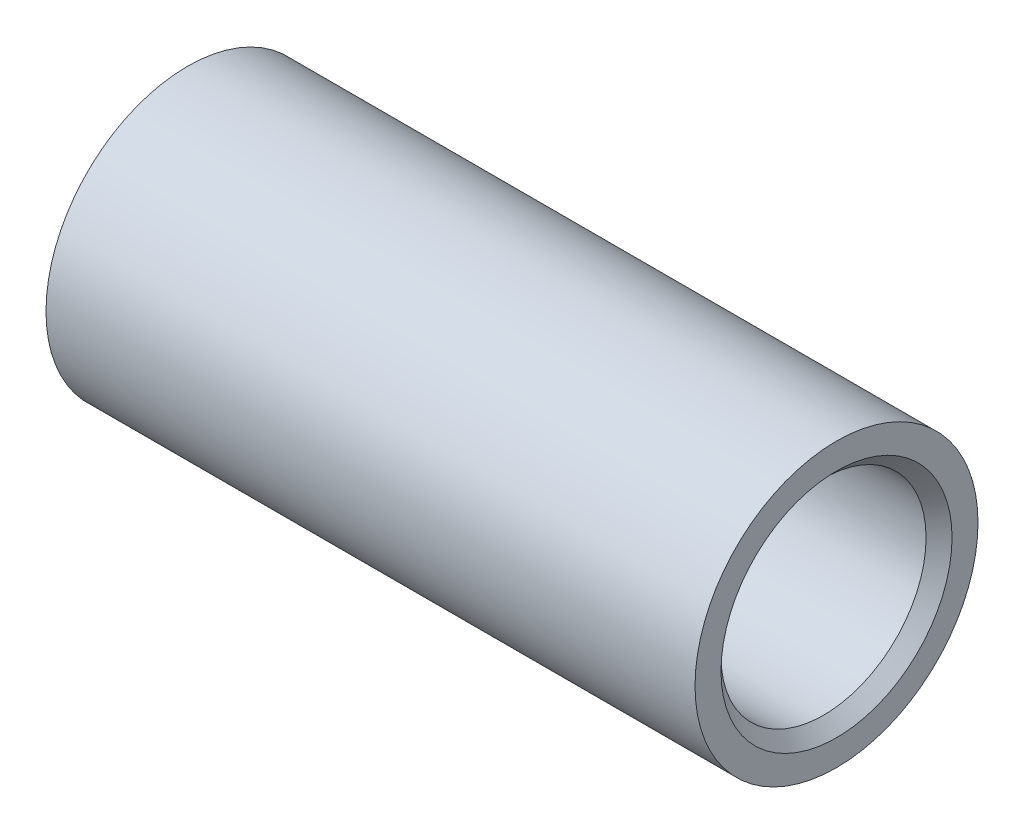
ISO-10303-21;
HEADER;
FILE_DESCRIPTION(('STEP AP214'),'2;1');
FILE_NAME('part.step','',(''),(''),'','','');
FILE_SCHEMA(('AUTOMOTIVE_DESIGN { 1 0 10303 214 1 1 1 1 }'));
ENDSEC;
DATA;
#1=APPLICATION_CONTEXT('core data for automotive mechanical design processes');
#2=APPLICATION_PROTOCOL_DEFINITION('international standard','automotive_design',2000,#1);
#3=PRODUCT_CONTEXT('',#1,'mechanical');
#4=PRODUCT('Part','Part','',(#3));
#5=PRODUCT_RELATED_PRODUCT_CATEGORY('part','',(#4));
#6=PRODUCT_DEFINITION_FORMATION('','',#4);
#7=PRODUCT_DEFINITION_CONTEXT('part definition',#1,'design');
#8=PRODUCT_DEFINITION('design','',#6,#7);
#9=PRODUCT_DEFINITION_SHAPE('','',#8);
#10=(LENGTH_UNIT() NAMED_UNIT(*) SI_UNIT(.MILLI.,.METRE.));
#11=(NAMED_UNIT(*) PLANE_ANGLE_UNIT() SI_UNIT($,.RADIAN.));
#12=(NAMED_UNIT(*) SI_UNIT($,.STERADIAN.) SOLID_ANGLE_UNIT());
#13=UNCERTAINTY_MEASURE_WITH_UNIT(LENGTH_MEASURE(1.E-05),#10,'distance_accuracy_value','');
#14=(GEOMETRIC_REPRESENTATION_CONTEXT(3) GLOBAL_UNCERTAINTY_ASSIGNED_CONTEXT((#13)) GLOBAL_UNIT_ASSIGNED_CONTEXT((#10,
#11,#12)) REPRESENTATION_CONTEXT('',''));
#15=CARTESIAN_POINT('',(0.,0.,0.));
#16=DIRECTION('',(0.,0.,1.));
#17=DIRECTION('',(1.,0.,0.));
#18=AXIS2_PLACEMENT_3D('',#15,#16,#17);
#19=CARTESIAN_POINT('',(0.,2.7686,0.));
#20=DIRECTION('',(1.,0.,0.));
#21=DIRECTION('',(0.,0.,-1.));
#22=AXIS2_PLACEMENT_3D('',#19,#20,#21);
#23=PLANE('',#22);
#24=CARTESIAN_POINT('',(0.,0.,0.));
#25=DIRECTION('',(-1.,0.,0.));
#26=DIRECTION('',(0.,0.,1.));
#27=AXIS2_PLACEMENT_3D('',#24,#25,#26);
#28=CIRCLE('',#27,2.0066);
#29=CARTESIAN_POINT('',(0.,0.,2.0066));
#30=VERTEX_POINT('',#29);
#31=EDGE_CURVE('E91',#30,#30,#28,.T.);
#32=ORIENTED_EDGE('',*,*,#31,.F.);
#33=EDGE_LOOP('',(#32));
#34=FACE_BOUND('',#33,.T.);
#35=CARTESIAN_POINT('',(0.,0.,0.));
#36=DIRECTION('',(-1.,0.,0.));
#37=DIRECTION('',(0.,0.,1.));
#38=AXIS2_PLACEMENT_3D('',#35,#36,#37);
#39=CIRCLE('',#38,2.7686);
#40=CARTESIAN_POINT('',(0.,0.,2.7686));
#41=VERTEX_POINT('',#40);
#42=EDGE_CURVE('E64',#41,#41,#39,.T.);
#43=ORIENTED_EDGE('',*,*,#42,.T.);
#44=EDGE_LOOP('',(#43));
#45=FACE_BOUND('',#44,.T.);
#46=ADVANCED_FACE('F50',(#34,#45),#23,.F.);
#47=CARTESIAN_POINT('',(-4.56175733291189,0.,0.));
#48=DIRECTION('',(-1.,0.,0.));
#49=DIRECTION('',(0.,0.,1.));
#50=AXIS2_PLACEMENT_3D('',#47,#48,#49);
#51=CYLINDRICAL_SURFACE('',#50,2.7686);
#52=ORIENTED_EDGE('',*,*,#42,.F.);
#53=EDGE_LOOP('',(#52));
#54=FACE_BOUND('',#53,.T.);
#55=CARTESIAN_POINT('',(12.7,0.,0.));
#56=DIRECTION('',(-1.,0.,0.));
#57=DIRECTION('',(0.,0.,1.));
#58=AXIS2_PLACEMENT_3D('',#55,#56,#57);
#59=CIRCLE('',#58,2.7686);
#60=CARTESIAN_POINT('',(12.7,0.,2.7686));
#61=VERTEX_POINT('',#60);
#62=EDGE_CURVE('E69',#61,#61,#59,.T.);
#63=ORIENTED_EDGE('',*,*,#62,.T.);
#64=EDGE_LOOP('',(#63));
#65=FACE_BOUND('',#64,.T.);
#66=ADVANCED_FACE('F100',(#54,#65),#51,.T.);
#67=CARTESIAN_POINT('',(12.7,2.7686,0.));
#68=DIRECTION('',(-1.,0.,0.));
#69=DIRECTION('',(0.,0.,1.));
#70=AXIS2_PLACEMENT_3D('',#67,#68,#69);
#71=PLANE('',#70);
#72=CARTESIAN_POINT('',(12.7,0.,0.));
#73=DIRECTION('',(-1.,0.,0.));
#74=DIRECTION('',(0.,0.,1.));
#75=AXIS2_PLACEMENT_3D('',#72,#73,#74);
#76=CIRCLE('',#75,2.2606);
#77=CARTESIAN_POINT('',(12.7,0.,2.2606));
#78=VERTEX_POINT('',#77);
#79=EDGE_CURVE('E59',#78,#78,#76,.T.);
#80=ORIENTED_EDGE('',*,*,#79,.T.);
#81=EDGE_LOOP('',(#80));
#82=FACE_BOUND('',#81,.T.);
#83=ORIENTED_EDGE('',*,*,#62,.F.);
#84=EDGE_LOOP('',(#83));
#85=FACE_BOUND('',#84,.T.);
#86=ADVANCED_FACE('F105',(#82,#85),#71,.F.);
#87=CARTESIAN_POINT('',(-4.56175733291189,0.,0.));
#88=DIRECTION('',(-1.,0.,0.));
#89=DIRECTION('',(0.,0.,1.));
#90=AXIS2_PLACEMENT_3D('',#87,#88,#89);
#91=CYLINDRICAL_SURFACE('',#90,2.0066);
#92=CARTESIAN_POINT('',(12.446,0.,0.));
#93=DIRECTION('',(-1.,0.,0.));
#94=DIRECTION('',(0.,0.,1.));
#95=AXIS2_PLACEMENT_3D('',#92,#93,#94);
#96=CIRCLE('',#95,2.0066);
#97=CARTESIAN_POINT('',(12.446,0.,2.0066));
#98=VERTEX_POINT('',#97);
#99=EDGE_CURVE('E12',#98,#98,#96,.F.);
#100=ORIENTED_EDGE('',*,*,#99,.T.);
#101=EDGE_LOOP('',(#100));
#102=FACE_BOUND('',#101,.T.);
#103=CARTESIAN_POINT('',(4.3434,0.,0.));
#104=DIRECTION('',(-1.,0.,0.));
#105=DIRECTION('',(0.,0.,1.));
#106=AXIS2_PLACEMENT_3D('',#103,#104,#105);
#107=CIRCLE('',#106,2.0066);
#108=CARTESIAN_POINT('',(4.3434,0.,2.0066));
#109=VERTEX_POINT('',#108);
#110=EDGE_CURVE('E75',#109,#109,#107,.T.);
#111=ORIENTED_EDGE('',*,*,#110,.T.);
#112=EDGE_LOOP('',(#111));
#113=FACE_BOUND('',#112,.T.);
#114=ADVANCED_FACE('F110',(#102,#113),#91,.F.);
#115=CARTESIAN_POINT('',(2.4531587330311,0.,0.));
#116=DIRECTION('',(-1.,0.,0.));
#117=DIRECTION('',(0.,0.,1.));
#118=AXIS2_PLACEMENT_3D('',#115,#116,#117);
#119=DEGENERATE_TOROIDAL_SURFACE('',#118,0.30995980459975,2.54,.T.);
#120=ORIENTED_EDGE('',*,*,#110,.F.);
#121=EDGE_LOOP('',(#120));
#122=FACE_BOUND('',#121,.T.);
#123=CARTESIAN_POINT('',(4.99216509195135,0.,0.));
#124=DIRECTION('',(-1.,0.,0.));
#125=DIRECTION('',(0.,0.,1.));
#126=AXIS2_PLACEMENT_3D('',#123,#124,#125);
#127=CIRCLE('',#126,0.381);
#128=CARTESIAN_POINT('',(4.99216509195135,0.,0.381));
#129=VERTEX_POINT('',#128);
#130=EDGE_CURVE('E79',#129,#129,#127,.T.);
#131=ORIENTED_EDGE('',*,*,#130,.T.);
#132=EDGE_LOOP('',(#131));
#133=FACE_BOUND('',#132,.T.);
#134=ADVANCED_FACE('F115',(#122,#133),#119,.T.);
#135=CARTESIAN_POINT('',(-4.56175733291189,0.,0.));
#136=DIRECTION('',(-1.,0.,0.));
#137=DIRECTION('',(0.,0.,1.));
#138=AXIS2_PLACEMENT_3D('',#135,#136,#137);
#139=CYLINDRICAL_SURFACE('',#138,0.381);
#140=ORIENTED_EDGE('',*,*,#130,.F.);
#141=EDGE_LOOP('',(#140));
#142=FACE_BOUND('',#141,.T.);
#143=CARTESIAN_POINT('',(4.48416509195135,0.,0.));
#144=DIRECTION('',(-1.,0.,0.));
#145=DIRECTION('',(0.,0.,1.));
#146=AXIS2_PLACEMENT_3D('',#143,#144,#145);
#147=CIRCLE('',#146,0.381);
#148=CARTESIAN_POINT('',(4.48416509195135,0.,0.381));
#149=VERTEX_POINT('',#148);
#150=EDGE_CURVE('E83',#149,#149,#147,.T.);
#151=ORIENTED_EDGE('',*,*,#150,.T.);
#152=EDGE_LOOP('',(#151));
#153=FACE_BOUND('',#152,.T.);
#154=ADVANCED_FACE('F120',(#142,#153),#139,.F.);
#155=CARTESIAN_POINT('',(1.9451587330311,0.,0.));
#156=DIRECTION('',(-1.,0.,0.));
#157=DIRECTION('',(0.,0.,1.));
#158=AXIS2_PLACEMENT_3D('',#155,#156,#157);
#159=DEGENERATE_TOROIDAL_SURFACE('',#158,0.309959804599751,2.54,.T.);
#160=ORIENTED_EDGE('',*,*,#150,.F.);
#161=EDGE_LOOP('',(#160));
#162=FACE_BOUND('',#161,.T.);
#163=CARTESIAN_POINT('',(3.8354,0.,0.));
#164=DIRECTION('',(-1.,0.,0.));
#165=DIRECTION('',(0.,0.,1.));
#166=AXIS2_PLACEMENT_3D('',#163,#164,#165);
#167=CIRCLE('',#166,2.0066);
#168=CARTESIAN_POINT('',(3.8354,0.,2.0066));
#169=VERTEX_POINT('',#168);
#170=EDGE_CURVE('E87',#169,#169,#167,.T.);
#171=ORIENTED_EDGE('',*,*,#170,.T.);
#172=EDGE_LOOP('',(#171));
#173=FACE_BOUND('',#172,.T.);
#174=ADVANCED_FACE('F124',(#162,#173),#159,.F.);
#175=CARTESIAN_POINT('',(-4.56175733291189,0.,0.));
#176=DIRECTION('',(-1.,0.,0.));
#177=DIRECTION('',(0.,0.,1.));
#178=AXIS2_PLACEMENT_3D('',#175,#176,#177);
#179=CYLINDRICAL_SURFACE('',#178,2.0066);
#180=ORIENTED_EDGE('',*,*,#170,.F.);
#181=EDGE_LOOP('',(#180));
#182=FACE_BOUND('',#181,.T.);
#183=ORIENTED_EDGE('',*,*,#31,.T.);
#184=EDGE_LOOP('',(#183));
#185=FACE_BOUND('',#184,.T.);
#186=ADVANCED_FACE('F96',(#182,#185),#179,.F.);
#187=CARTESIAN_POINT('',(12.7,0.,0.));
#188=DIRECTION('',(1.,0.,0.));
#189=DIRECTION('',(0.,0.,-1.));
#190=AXIS2_PLACEMENT_3D('',#187,#188,#189);
#191=CONICAL_SURFACE('',#190,2.2606,0.785398163397444);
#192=ORIENTED_EDGE('',*,*,#99,.F.);
#193=EDGE_LOOP('',(#192));
#194=FACE_BOUND('',#193,.T.);
#195=ORIENTED_EDGE('',*,*,#79,.F.);
#196=EDGE_LOOP('',(#195));
#197=FACE_BOUND('',#196,.T.);
#198=ADVANCED_FACE('F53',(#194,#197),#191,.F.);
#199=CLOSED_SHELL('',(#46,#66,#86,#114,#134,#154,#174,#186,#198));
#200=MANIFOLD_SOLID_BREP('B2',#199);
#201=ADVANCED_BREP_SHAPE_REPRESENTATION('',(#18,#200),#14);
#202=SHAPE_DEFINITION_REPRESENTATION(#9,#201);
ENDSEC;
END-ISO-10303-21;
